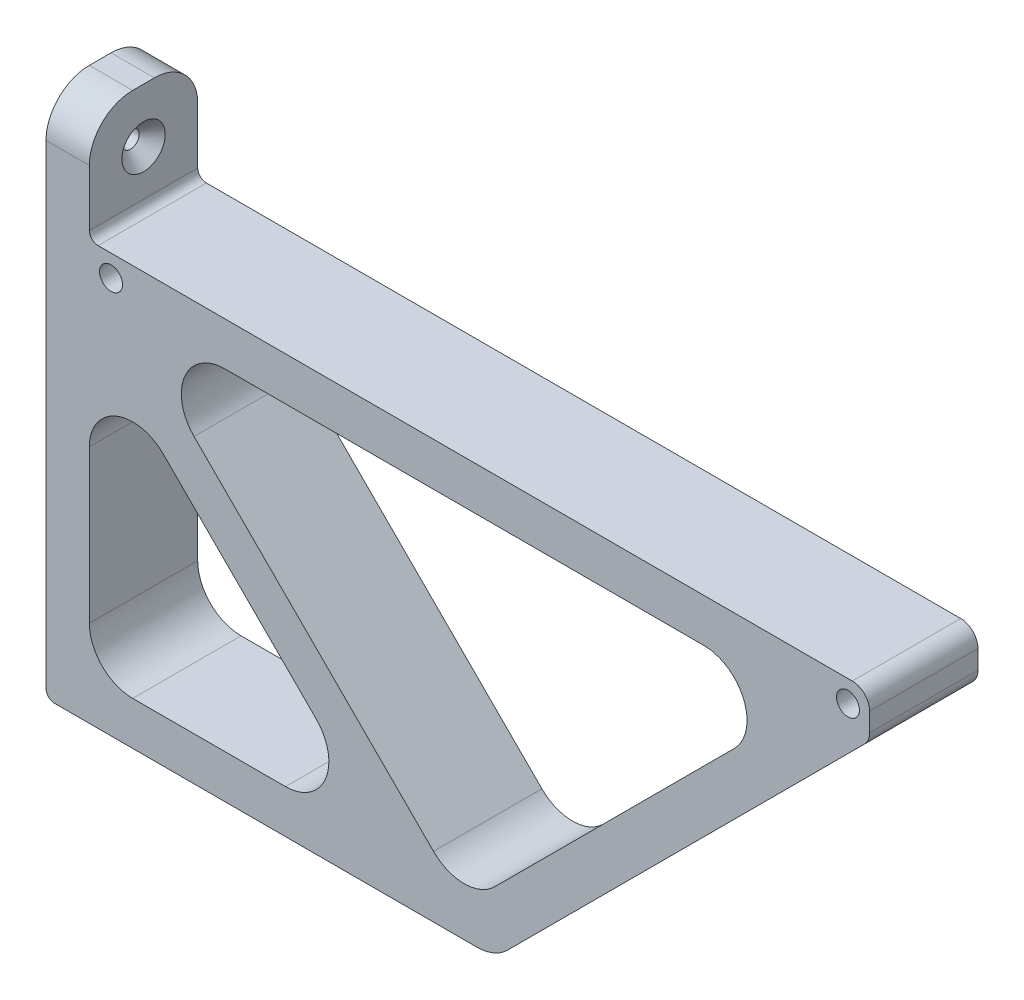
ISO-10303-21;
HEADER;
FILE_DESCRIPTION(('STEP AP214'),'2;1');
FILE_NAME('part.step','',(''),(''),'','','');
FILE_SCHEMA(('AUTOMOTIVE_DESIGN { 1 0 10303 214 1 1 1 1 }'));
ENDSEC;
DATA;
#1=APPLICATION_CONTEXT('core data for automotive mechanical design processes');
#2=APPLICATION_PROTOCOL_DEFINITION('international standard','automotive_design',2000,#1);
#3=PRODUCT_CONTEXT('',#1,'mechanical');
#4=PRODUCT('Part','Part','',(#3));
#5=PRODUCT_RELATED_PRODUCT_CATEGORY('part','',(#4));
#6=PRODUCT_DEFINITION_FORMATION('','',#4);
#7=PRODUCT_DEFINITION_CONTEXT('part definition',#1,'design');
#8=PRODUCT_DEFINITION('design','',#6,#7);
#9=PRODUCT_DEFINITION_SHAPE('','',#8);
#10=(LENGTH_UNIT() NAMED_UNIT(*) SI_UNIT(.MILLI.,.METRE.));
#11=(NAMED_UNIT(*) PLANE_ANGLE_UNIT() SI_UNIT($,.RADIAN.));
#12=(NAMED_UNIT(*) SI_UNIT($,.STERADIAN.) SOLID_ANGLE_UNIT());
#13=UNCERTAINTY_MEASURE_WITH_UNIT(LENGTH_MEASURE(1.E-05),#10,'distance_accuracy_value','');
#14=(GEOMETRIC_REPRESENTATION_CONTEXT(3) GLOBAL_UNCERTAINTY_ASSIGNED_CONTEXT((#13)) GLOBAL_UNIT_ASSIGNED_CONTEXT((#10,
#11,#12)) REPRESENTATION_CONTEXT('',''));
#15=CARTESIAN_POINT('',(0.,0.,0.));
#16=DIRECTION('',(0.,0.,1.));
#17=DIRECTION('',(1.,0.,0.));
#18=AXIS2_PLACEMENT_3D('',#15,#16,#17);
#19=CARTESIAN_POINT('',(0.,0.,25.));
#20=DIRECTION('',(0.,0.,1.));
#21=DIRECTION('',(1.,0.,0.));
#22=AXIS2_PLACEMENT_3D('',#19,#20,#21);
#23=PLANE('',#22);
#24=CARTESIAN_POINT('',(5.,-30.,25.));
#25=DIRECTION('',(0.,0.,1.));
#26=DIRECTION('',(1.,0.,0.));
#27=AXIS2_PLACEMENT_3D('',#24,#25,#26);
#28=CIRCLE('',#27,2.65);
#29=CARTESIAN_POINT('',(7.65,-30.,25.));
#30=VERTEX_POINT('',#29);
#31=EDGE_CURVE('E693',#30,#30,#28,.T.);
#32=ORIENTED_EDGE('',*,*,#31,.F.);
#33=EDGE_LOOP('',(#32));
#34=FACE_BOUND('',#33,.T.);
#35=DIRECTION('',(0.,-1.,0.));
#36=VECTOR('',#35,1.);
#37=CARTESIAN_POINT('',(-10.,0.,25.));
#38=LINE('',#37,#36);
#39=CARTESIAN_POINT('',(-10.,-10.,25.));
#40=VERTEX_POINT('',#39);
#41=CARTESIAN_POINT('',(-9.99999999999999,-119.464466094067,25.));
#42=VERTEX_POINT('',#41);
#43=EDGE_CURVE('E214',#40,#42,#38,.T.);
#44=ORIENTED_EDGE('',*,*,#43,.T.);
#45=CARTESIAN_POINT('',(-7.99999999999998,-119.464466094067,25.));
#46=DIRECTION('',(0.,0.,1.));
#47=DIRECTION('',(1.,0.,0.));
#48=AXIS2_PLACEMENT_3D('',#45,#46,#47);
#49=CIRCLE('',#48,2.);
#50=CARTESIAN_POINT('',(-7.99999999999998,-121.464466094067,25.));
#51=VERTEX_POINT('',#50);
#52=EDGE_CURVE('E344',#42,#51,#49,.T.);
#53=ORIENTED_EDGE('',*,*,#52,.T.);
#54=DIRECTION('',(1.,0.,0.));
#55=VECTOR('',#54,1.);
#56=CARTESIAN_POINT('',(93.5355339059347,-121.464466094067,25.));
#57=LINE('',#56,#55);
#58=CARTESIAN_POINT('',(89.3933982822037,-121.464466094067,25.));
#59=VERTEX_POINT('',#58);
#60=EDGE_CURVE('E661',#51,#59,#57,.T.);
#61=ORIENTED_EDGE('',*,*,#60,.T.);
#62=CARTESIAN_POINT('',(89.3933982822037,-111.464466094067,25.));
#63=DIRECTION('',(0.,0.,1.));
#64=DIRECTION('',(1.,0.,0.));
#65=AXIS2_PLACEMENT_3D('',#62,#63,#64);
#66=CIRCLE('',#65,10.);
#67=CARTESIAN_POINT('',(96.4644660940693,-118.535533905933,25.));
#68=VERTEX_POINT('',#67);
#69=EDGE_CURVE('E281',#59,#68,#66,.T.);
#70=ORIENTED_EDGE('',*,*,#69,.T.);
#71=DIRECTION('',(0.707106781186539,0.707106781186556,0.));
#72=VECTOR('',#71,1.);
#73=CARTESIAN_POINT('',(93.5355339059347,-121.464466094067,25.));
#74=LINE('',#73,#72);
#75=CARTESIAN_POINT('',(178.828427124746,-36.1715728752538,25.));
#76=VERTEX_POINT('',#75);
#77=EDGE_CURVE('E664',#68,#76,#74,.T.);
#78=ORIENTED_EDGE('',*,*,#77,.T.);
#79=CARTESIAN_POINT('',(176.,-33.3431457505076,25.));
#80=DIRECTION('',(0.,0.,1.));
#81=DIRECTION('',(1.,0.,0.));
#82=AXIS2_PLACEMENT_3D('',#79,#80,#81);
#83=CIRCLE('',#82,4.);
#84=CARTESIAN_POINT('',(180.,-33.3431457505076,25.));
#85=VERTEX_POINT('',#84);
#86=EDGE_CURVE('E267',#76,#85,#83,.T.);
#87=ORIENTED_EDGE('',*,*,#86,.T.);
#88=DIRECTION('',(0.,1.,0.));
#89=VECTOR('',#88,1.);
#90=CARTESIAN_POINT('',(180.,-25.,25.));
#91=LINE('',#90,#89);
#92=CARTESIAN_POINT('',(180.,-29.,25.));
#93=VERTEX_POINT('',#92);
#94=EDGE_CURVE('E369',#85,#93,#91,.T.);
#95=ORIENTED_EDGE('',*,*,#94,.T.);
#96=CARTESIAN_POINT('',(176.,-29.,25.));
#97=DIRECTION('',(0.,0.,1.));
#98=DIRECTION('',(1.,0.,0.));
#99=AXIS2_PLACEMENT_3D('',#96,#97,#98);
#100=CIRCLE('',#99,4.);
#101=CARTESIAN_POINT('',(176.,-25.,25.));
#102=VERTEX_POINT('',#101);
#103=EDGE_CURVE('E265',#93,#102,#100,.T.);
#104=ORIENTED_EDGE('',*,*,#103,.T.);
#105=DIRECTION('',(-1.,0.,0.));
#106=VECTOR('',#105,1.);
#107=CARTESIAN_POINT('',(0.,-25.,25.));
#108=LINE('',#107,#106);
#109=CARTESIAN_POINT('',(2.,-25.,25.));
#110=VERTEX_POINT('',#109);
#111=EDGE_CURVE('E366',#102,#110,#108,.T.);
#112=ORIENTED_EDGE('',*,*,#111,.T.);
#113=CARTESIAN_POINT('',(2.,-23.,25.));
#114=DIRECTION('',(0.,0.,1.));
#115=DIRECTION('',(1.,0.,0.));
#116=AXIS2_PLACEMENT_3D('',#113,#114,#115);
#117=CIRCLE('',#116,2.);
#118=CARTESIAN_POINT('',(0.,-23.,25.));
#119=VERTEX_POINT('',#118);
#120=EDGE_CURVE('E11',#110,#119,#117,.F.);
#121=ORIENTED_EDGE('',*,*,#120,.T.);
#122=DIRECTION('',(0.,1.,0.));
#123=VECTOR('',#122,1.);
#124=CARTESIAN_POINT('',(0.,0.,25.));
#125=LINE('',#124,#123);
#126=CARTESIAN_POINT('',(0.,-10.,25.));
#127=VERTEX_POINT('',#126);
#128=EDGE_CURVE('E365',#119,#127,#125,.T.);
#129=ORIENTED_EDGE('',*,*,#128,.T.);
#130=DIRECTION('',(-1.,0.,0.));
#131=VECTOR('',#130,1.);
#132=CARTESIAN_POINT('',(-10.,-10.,25.));
#133=LINE('',#132,#131);
#134=EDGE_CURVE('E250',#127,#40,#133,.T.);
#135=ORIENTED_EDGE('',*,*,#134,.T.);
#136=EDGE_LOOP('',(#44,#53,#61,#70,#78,#87,#95,#104,#112,#121,#129,#135));
#137=FACE_BOUND('',#136,.T.);
#138=DIRECTION('',(1.,0.,0.));
#139=VECTOR('',#138,1.);
#140=CARTESIAN_POINT('',(0.,-111.464466094067,25.));
#141=LINE('',#140,#139);
#142=CARTESIAN_POINT('',(10.,-111.464466094067,25.));
#143=VERTEX_POINT('',#142);
#144=CARTESIAN_POINT('',(45.2512626584723,-111.464466094067,25.));
#145=VERTEX_POINT('',#144);
#146=EDGE_CURVE('E696',#143,#145,#141,.T.);
#147=ORIENTED_EDGE('',*,*,#146,.F.);
#148=CARTESIAN_POINT('',(10.,-101.464466094067,25.));
#149=DIRECTION('',(0.,0.,1.));
#150=DIRECTION('',(1.,0.,0.));
#151=AXIS2_PLACEMENT_3D('',#148,#149,#150);
#152=CIRCLE('',#151,10.);
#153=CARTESIAN_POINT('',(0.,-101.464466094067,25.));
#154=VERTEX_POINT('',#153);
#155=EDGE_CURVE('E319',#143,#154,#152,.F.);
#156=ORIENTED_EDGE('',*,*,#155,.T.);
#157=DIRECTION('',(0.,-1.,0.));
#158=VECTOR('',#157,1.);
#159=CARTESIAN_POINT('',(0.,-111.464466094067,25.));
#160=LINE('',#159,#158);
#161=CARTESIAN_POINT('',(0.,-66.2132034355959,25.));
#162=VERTEX_POINT('',#161);
#163=EDGE_CURVE('E686',#162,#154,#160,.T.);
#164=ORIENTED_EDGE('',*,*,#163,.F.);
#165=CARTESIAN_POINT('',(10.,-66.2132034355959,25.));
#166=DIRECTION('',(0.,0.,1.));
#167=DIRECTION('',(1.,0.,0.));
#168=AXIS2_PLACEMENT_3D('',#165,#166,#167);
#169=CIRCLE('',#168,10.);
#170=CARTESIAN_POINT('',(17.0710678118654,-59.1421356237304,25.));
#171=VERTEX_POINT('',#170);
#172=EDGE_CURVE('E315',#162,#171,#169,.F.);
#173=ORIENTED_EDGE('',*,*,#172,.T.);
#174=DIRECTION('',(-0.707106781186556,0.707106781186539,0.));
#175=VECTOR('',#174,1.);
#176=CARTESIAN_POINT('',(0.,-42.0710678118654,25.));
#177=LINE('',#176,#175);
#178=CARTESIAN_POINT('',(52.3223304703377,-94.3933982822018,25.));
#179=VERTEX_POINT('',#178);
#180=EDGE_CURVE('E376',#179,#171,#177,.T.);
#181=ORIENTED_EDGE('',*,*,#180,.F.);
#182=CARTESIAN_POINT('',(45.2512626584723,-101.464466094067,25.));
#183=DIRECTION('',(0.,0.,1.));
#184=DIRECTION('',(1.,0.,0.));
#185=AXIS2_PLACEMENT_3D('',#182,#183,#184);
#186=CIRCLE('',#185,10.);
#187=EDGE_CURVE('E323',#179,#145,#186,.F.);
#188=ORIENTED_EDGE('',*,*,#187,.T.);
#189=EDGE_LOOP('',(#147,#156,#164,#173,#181,#188));
#190=FACE_BOUND('',#189,.T.);
#191=CARTESIAN_POINT('',(175.,-30.,25.));
#192=DIRECTION('',(0.,0.,1.));
#193=DIRECTION('',(1.,0.,0.));
#194=AXIS2_PLACEMENT_3D('',#191,#192,#193);
#195=CIRCLE('',#194,2.65000000000001);
#196=CARTESIAN_POINT('',(177.65,-30.,25.));
#197=VERTEX_POINT('',#196);
#198=EDGE_CURVE('E704',#197,#197,#195,.T.);
#199=ORIENTED_EDGE('',*,*,#198,.F.);
#200=EDGE_LOOP('',(#199));
#201=FACE_BOUND('',#200,.T.);
#202=DIRECTION('',(0.707106781186556,-0.707106781186539,0.));
#203=VECTOR('',#202,1.);
#204=CARTESIAN_POINT('',(7.07106781186556,-35.,25.));
#205=LINE('',#204,#203);
#206=CARTESIAN_POINT('',(24.1421356237315,-52.0710678118656,25.));
#207=VERTEX_POINT('',#206);
#208=CARTESIAN_POINT('',(79.3933982822037,-107.322330470336,25.));
#209=VERTEX_POINT('',#208);
#210=EDGE_CURVE('E726',#207,#209,#205,.T.);
#211=ORIENTED_EDGE('',*,*,#210,.F.);
#212=CARTESIAN_POINT('',(31.2132034355969,-45.,25.));
#213=DIRECTION('',(0.,0.,1.));
#214=DIRECTION('',(1.,0.,0.));
#215=AXIS2_PLACEMENT_3D('',#212,#213,#214);
#216=CIRCLE('',#215,10.);
#217=CARTESIAN_POINT('',(31.2132034355969,-35.,25.));
#218=VERTEX_POINT('',#217);
#219=EDGE_CURVE('E335',#207,#218,#216,.F.);
#220=ORIENTED_EDGE('',*,*,#219,.T.);
#221=DIRECTION('',(-1.,0.,0.));
#222=VECTOR('',#221,1.);
#223=CARTESIAN_POINT('',(165.857864376269,-35.,25.));
#224=LINE('',#223,#222);
#225=CARTESIAN_POINT('',(141.715728752539,-35.,25.));
#226=VERTEX_POINT('',#225);
#227=EDGE_CURVE('E716',#226,#218,#224,.T.);
#228=ORIENTED_EDGE('',*,*,#227,.F.);
#229=CARTESIAN_POINT('',(141.715728752539,-45.,25.));
#230=DIRECTION('',(0.,0.,1.));
#231=DIRECTION('',(1.,0.,0.));
#232=AXIS2_PLACEMENT_3D('',#229,#230,#231);
#233=CIRCLE('',#232,10.);
#234=CARTESIAN_POINT('',(148.786796564404,-52.0710678118654,25.));
#235=VERTEX_POINT('',#234);
#236=EDGE_CURVE('E331',#226,#235,#233,.F.);
#237=ORIENTED_EDGE('',*,*,#236,.T.);
#238=DIRECTION('',(0.707106781186539,0.707106781186556,0.));
#239=VECTOR('',#238,1.);
#240=CARTESIAN_POINT('',(86.4644660940693,-114.393398282202,25.));
#241=LINE('',#240,#239);
#242=CARTESIAN_POINT('',(93.5355339059347,-107.322330470336,25.));
#243=VERTEX_POINT('',#242);
#244=EDGE_CURVE('E710',#243,#235,#241,.T.);
#245=ORIENTED_EDGE('',*,*,#244,.F.);
#246=CARTESIAN_POINT('',(86.4644660940692,-100.251262658471,25.));
#247=DIRECTION('',(0.,0.,1.));
#248=DIRECTION('',(1.,0.,0.));
#249=AXIS2_PLACEMENT_3D('',#246,#247,#248);
#250=CIRCLE('',#249,10.);
#251=EDGE_CURVE('E327',#243,#209,#250,.F.);
#252=ORIENTED_EDGE('',*,*,#251,.T.);
#253=EDGE_LOOP('',(#211,#220,#228,#237,#245,#252));
#254=FACE_BOUND('',#253,.T.);
#255=ADVANCED_FACE('F35',(#34,#137,#190,#201,#254),#23,.T.);
#256=CARTESIAN_POINT('',(0.,0.,0.));
#257=DIRECTION('',(0.,0.,1.));
#258=DIRECTION('',(1.,0.,0.));
#259=AXIS2_PLACEMENT_3D('',#256,#257,#258);
#260=PLANE('',#259);
#261=CARTESIAN_POINT('',(175.,-30.,0.));
#262=DIRECTION('',(0.,0.,1.));
#263=DIRECTION('',(1.,0.,0.));
#264=AXIS2_PLACEMENT_3D('',#261,#262,#263);
#265=CIRCLE('',#264,2.65000000000001);
#266=CARTESIAN_POINT('',(177.65,-30.,0.));
#267=VERTEX_POINT('',#266);
#268=EDGE_CURVE('E707',#267,#267,#265,.T.);
#269=ORIENTED_EDGE('',*,*,#268,.T.);
#270=EDGE_LOOP('',(#269));
#271=FACE_BOUND('',#270,.T.);
#272=CARTESIAN_POINT('',(5.,-30.,0.));
#273=DIRECTION('',(0.,0.,1.));
#274=DIRECTION('',(1.,0.,0.));
#275=AXIS2_PLACEMENT_3D('',#272,#273,#274);
#276=CIRCLE('',#275,2.65);
#277=CARTESIAN_POINT('',(7.65,-30.,0.));
#278=VERTEX_POINT('',#277);
#279=EDGE_CURVE('E701',#278,#278,#276,.T.);
#280=ORIENTED_EDGE('',*,*,#279,.T.);
#281=EDGE_LOOP('',(#280));
#282=FACE_BOUND('',#281,.T.);
#283=DIRECTION('',(-0.707106781186556,0.707106781186539,0.));
#284=VECTOR('',#283,1.);
#285=CARTESIAN_POINT('',(0.,-42.0710678118654,0.));
#286=LINE('',#285,#284);
#287=CARTESIAN_POINT('',(52.3223304703377,-94.3933982822018,0.));
#288=VERTEX_POINT('',#287);
#289=CARTESIAN_POINT('',(17.0710678118654,-59.1421356237304,0.));
#290=VERTEX_POINT('',#289);
#291=EDGE_CURVE('E683',#288,#290,#286,.T.);
#292=ORIENTED_EDGE('',*,*,#291,.T.);
#293=CARTESIAN_POINT('',(10.,-66.2132034355959,0.));
#294=DIRECTION('',(0.,0.,1.));
#295=DIRECTION('',(1.,0.,0.));
#296=AXIS2_PLACEMENT_3D('',#293,#294,#295);
#297=CIRCLE('',#296,10.);
#298=CARTESIAN_POINT('',(0.,-66.2132034355959,0.));
#299=VERTEX_POINT('',#298);
#300=EDGE_CURVE('E313',#290,#299,#297,.T.);
#301=ORIENTED_EDGE('',*,*,#300,.T.);
#302=DIRECTION('',(0.,-1.,0.));
#303=VECTOR('',#302,1.);
#304=CARTESIAN_POINT('',(0.,-111.464466094067,0.));
#305=LINE('',#304,#303);
#306=CARTESIAN_POINT('',(0.,-101.464466094067,0.));
#307=VERTEX_POINT('',#306);
#308=EDGE_CURVE('E690',#299,#307,#305,.T.);
#309=ORIENTED_EDGE('',*,*,#308,.T.);
#310=CARTESIAN_POINT('',(10.,-101.464466094067,0.));
#311=DIRECTION('',(0.,0.,1.));
#312=DIRECTION('',(1.,0.,0.));
#313=AXIS2_PLACEMENT_3D('',#310,#311,#312);
#314=CIRCLE('',#313,10.);
#315=CARTESIAN_POINT('',(10.,-111.464466094067,0.));
#316=VERTEX_POINT('',#315);
#317=EDGE_CURVE('E317',#307,#316,#314,.T.);
#318=ORIENTED_EDGE('',*,*,#317,.T.);
#319=DIRECTION('',(1.,0.,0.));
#320=VECTOR('',#319,1.);
#321=CARTESIAN_POINT('',(0.,-111.464466094067,0.));
#322=LINE('',#321,#320);
#323=CARTESIAN_POINT('',(45.2512626584723,-111.464466094067,0.));
#324=VERTEX_POINT('',#323);
#325=EDGE_CURVE('E687',#316,#324,#322,.T.);
#326=ORIENTED_EDGE('',*,*,#325,.T.);
#327=CARTESIAN_POINT('',(45.2512626584723,-101.464466094067,0.));
#328=DIRECTION('',(0.,0.,1.));
#329=DIRECTION('',(1.,0.,0.));
#330=AXIS2_PLACEMENT_3D('',#327,#328,#329);
#331=CIRCLE('',#330,10.);
#332=EDGE_CURVE('E321',#324,#288,#331,.T.);
#333=ORIENTED_EDGE('',*,*,#332,.T.);
#334=EDGE_LOOP('',(#292,#301,#309,#318,#326,#333));
#335=FACE_BOUND('',#334,.T.);
#336=DIRECTION('',(1.,0.,0.));
#337=VECTOR('',#336,1.);
#338=CARTESIAN_POINT('',(93.5355339059347,-121.464466094067,0.));
#339=LINE('',#338,#337);
#340=CARTESIAN_POINT('',(-7.99999999999998,-121.464466094067,0.));
#341=VERTEX_POINT('',#340);
#342=CARTESIAN_POINT('',(89.3933982822037,-121.464466094067,0.));
#343=VERTEX_POINT('',#342);
#344=EDGE_CURVE('E375',#341,#343,#339,.T.);
#345=ORIENTED_EDGE('',*,*,#344,.F.);
#346=CARTESIAN_POINT('',(-7.99999999999998,-119.464466094067,0.));
#347=DIRECTION('',(0.,0.,1.));
#348=DIRECTION('',(1.,0.,0.));
#349=AXIS2_PLACEMENT_3D('',#346,#347,#348);
#350=CIRCLE('',#349,2.);
#351=CARTESIAN_POINT('',(-9.99999999999999,-119.464466094067,0.));
#352=VERTEX_POINT('',#351);
#353=EDGE_CURVE('E340',#341,#352,#350,.F.);
#354=ORIENTED_EDGE('',*,*,#353,.T.);
#355=DIRECTION('',(0.,-1.,0.));
#356=VECTOR('',#355,1.);
#357=CARTESIAN_POINT('',(-10.,0.,0.));
#358=LINE('',#357,#356);
#359=CARTESIAN_POINT('',(-10.,-10.,0.));
#360=VERTEX_POINT('',#359);
#361=EDGE_CURVE('E373',#360,#352,#358,.T.);
#362=ORIENTED_EDGE('',*,*,#361,.F.);
#363=DIRECTION('',(-1.,0.,0.));
#364=VECTOR('',#363,1.);
#365=CARTESIAN_POINT('',(0.,-10.,0.));
#366=LINE('',#365,#364);
#367=CARTESIAN_POINT('',(0.,-10.,0.));
#368=VERTEX_POINT('',#367);
#369=EDGE_CURVE('E244',#360,#368,#366,.F.);
#370=ORIENTED_EDGE('',*,*,#369,.T.);
#371=DIRECTION('',(0.,1.,0.));
#372=VECTOR('',#371,1.);
#373=CARTESIAN_POINT('',(0.,0.,0.));
#374=LINE('',#373,#372);
#375=CARTESIAN_POINT('',(0.,-23.,0.));
#376=VERTEX_POINT('',#375);
#377=EDGE_CURVE('E356',#376,#368,#374,.T.);
#378=ORIENTED_EDGE('',*,*,#377,.F.);
#379=CARTESIAN_POINT('',(2.,-23.,0.));
#380=DIRECTION('',(0.,0.,1.));
#381=DIRECTION('',(1.,0.,0.));
#382=AXIS2_PLACEMENT_3D('',#379,#380,#381);
#383=CIRCLE('',#382,2.);
#384=CARTESIAN_POINT('',(2.,-25.,0.));
#385=VERTEX_POINT('',#384);
#386=EDGE_CURVE('E43',#376,#385,#383,.T.);
#387=ORIENTED_EDGE('',*,*,#386,.T.);
#388=DIRECTION('',(-1.,0.,0.));
#389=VECTOR('',#388,1.);
#390=CARTESIAN_POINT('',(0.,-25.,0.));
#391=LINE('',#390,#389);
#392=CARTESIAN_POINT('',(176.,-25.,0.));
#393=VERTEX_POINT('',#392);
#394=EDGE_CURVE('E355',#393,#385,#391,.T.);
#395=ORIENTED_EDGE('',*,*,#394,.F.);
#396=CARTESIAN_POINT('',(176.,-29.,0.));
#397=DIRECTION('',(0.,0.,1.));
#398=DIRECTION('',(1.,0.,0.));
#399=AXIS2_PLACEMENT_3D('',#396,#397,#398);
#400=CIRCLE('',#399,4.);
#401=CARTESIAN_POINT('',(180.,-29.,0.));
#402=VERTEX_POINT('',#401);
#403=EDGE_CURVE('E257',#393,#402,#400,.F.);
#404=ORIENTED_EDGE('',*,*,#403,.T.);
#405=DIRECTION('',(0.,1.,0.));
#406=VECTOR('',#405,1.);
#407=CARTESIAN_POINT('',(180.,-25.,0.));
#408=LINE('',#407,#406);
#409=CARTESIAN_POINT('',(180.,-33.3431457505076,0.));
#410=VERTEX_POINT('',#409);
#411=EDGE_CURVE('E361',#410,#402,#408,.T.);
#412=ORIENTED_EDGE('',*,*,#411,.F.);
#413=CARTESIAN_POINT('',(176.,-33.3431457505076,0.));
#414=DIRECTION('',(0.,0.,1.));
#415=DIRECTION('',(1.,0.,0.));
#416=AXIS2_PLACEMENT_3D('',#413,#414,#415);
#417=CIRCLE('',#416,4.);
#418=CARTESIAN_POINT('',(178.828427124746,-36.1715728752538,0.));
#419=VERTEX_POINT('',#418);
#420=EDGE_CURVE('E259',#410,#419,#417,.F.);
#421=ORIENTED_EDGE('',*,*,#420,.T.);
#422=DIRECTION('',(0.707106781186539,0.707106781186556,0.));
#423=VECTOR('',#422,1.);
#424=CARTESIAN_POINT('',(93.5355339059347,-121.464466094067,0.));
#425=LINE('',#424,#423);
#426=CARTESIAN_POINT('',(96.4644660940693,-118.535533905933,0.));
#427=VERTEX_POINT('',#426);
#428=EDGE_CURVE('E378',#427,#419,#425,.T.);
#429=ORIENTED_EDGE('',*,*,#428,.F.);
#430=CARTESIAN_POINT('',(89.3933982822037,-111.464466094067,0.));
#431=DIRECTION('',(0.,0.,1.));
#432=DIRECTION('',(1.,0.,0.));
#433=AXIS2_PLACEMENT_3D('',#430,#431,#432);
#434=CIRCLE('',#433,10.);
#435=EDGE_CURVE('E275',#427,#343,#434,.F.);
#436=ORIENTED_EDGE('',*,*,#435,.T.);
#437=EDGE_LOOP('',(#345,#354,#362,#370,#378,#387,#395,#404,#412,#421,#429,#436));
#438=FACE_BOUND('',#437,.T.);
#439=DIRECTION('',(0.707106781186539,0.707106781186556,0.));
#440=VECTOR('',#439,1.);
#441=CARTESIAN_POINT('',(86.4644660940693,-114.393398282202,0.));
#442=LINE('',#441,#440);
#443=CARTESIAN_POINT('',(93.5355339059347,-107.322330470336,0.));
#444=VERTEX_POINT('',#443);
#445=CARTESIAN_POINT('',(148.786796564404,-52.0710678118654,0.));
#446=VERTEX_POINT('',#445);
#447=EDGE_CURVE('E713',#444,#446,#442,.T.);
#448=ORIENTED_EDGE('',*,*,#447,.T.);
#449=CARTESIAN_POINT('',(141.715728752539,-45.,0.));
#450=DIRECTION('',(0.,0.,1.));
#451=DIRECTION('',(1.,0.,0.));
#452=AXIS2_PLACEMENT_3D('',#449,#450,#451);
#453=CIRCLE('',#452,10.);
#454=CARTESIAN_POINT('',(141.715728752539,-35.,0.));
#455=VERTEX_POINT('',#454);
#456=EDGE_CURVE('E329',#446,#455,#453,.T.);
#457=ORIENTED_EDGE('',*,*,#456,.T.);
#458=DIRECTION('',(-1.,0.,0.));
#459=VECTOR('',#458,1.);
#460=CARTESIAN_POINT('',(165.857864376269,-35.,0.));
#461=LINE('',#460,#459);
#462=CARTESIAN_POINT('',(31.2132034355969,-35.,0.));
#463=VERTEX_POINT('',#462);
#464=EDGE_CURVE('E720',#455,#463,#461,.T.);
#465=ORIENTED_EDGE('',*,*,#464,.T.);
#466=CARTESIAN_POINT('',(31.2132034355969,-45.,0.));
#467=DIRECTION('',(0.,0.,1.));
#468=DIRECTION('',(1.,0.,0.));
#469=AXIS2_PLACEMENT_3D('',#466,#467,#468);
#470=CIRCLE('',#469,10.);
#471=CARTESIAN_POINT('',(24.1421356237315,-52.0710678118656,0.));
#472=VERTEX_POINT('',#471);
#473=EDGE_CURVE('E333',#463,#472,#470,.T.);
#474=ORIENTED_EDGE('',*,*,#473,.T.);
#475=DIRECTION('',(0.707106781186556,-0.707106781186539,0.));
#476=VECTOR('',#475,1.);
#477=CARTESIAN_POINT('',(7.07106781186556,-35.,0.));
#478=LINE('',#477,#476);
#479=CARTESIAN_POINT('',(79.3933982822037,-107.322330470336,0.));
#480=VERTEX_POINT('',#479);
#481=EDGE_CURVE('E717',#472,#480,#478,.T.);
#482=ORIENTED_EDGE('',*,*,#481,.T.);
#483=CARTESIAN_POINT('',(86.4644660940692,-100.251262658471,0.));
#484=DIRECTION('',(0.,0.,1.));
#485=DIRECTION('',(1.,0.,0.));
#486=AXIS2_PLACEMENT_3D('',#483,#484,#485);
#487=CIRCLE('',#486,10.);
#488=EDGE_CURVE('E325',#480,#444,#487,.T.);
#489=ORIENTED_EDGE('',*,*,#488,.T.);
#490=EDGE_LOOP('',(#448,#457,#465,#474,#482,#489));
#491=FACE_BOUND('',#490,.T.);
#492=ADVANCED_FACE('F353',(#271,#282,#335,#438,#491),#260,.F.);
#493=CARTESIAN_POINT('',(0.,0.,25.));
#494=DIRECTION('',(0.,-1.,0.));
#495=DIRECTION('',(1.,0.,0.));
#496=AXIS2_PLACEMENT_3D('',#493,#494,#495);
#497=PLANE('',#496);
#498=DIRECTION('',(0.,0.,-1.));
#499=VECTOR('',#498,1.);
#500=CARTESIAN_POINT('',(0.,0.,25.));
#501=LINE('',#500,#499);
#502=CARTESIAN_POINT('',(0.,0.,15.));
#503=VERTEX_POINT('',#502);
#504=CARTESIAN_POINT('',(0.,0.,10.));
#505=VERTEX_POINT('',#504);
#506=EDGE_CURVE('E230',#503,#505,#501,.T.);
#507=ORIENTED_EDGE('',*,*,#506,.T.);
#508=DIRECTION('',(-1.,0.,0.));
#509=VECTOR('',#508,1.);
#510=CARTESIAN_POINT('',(0.,0.,10.));
#511=LINE('',#510,#509);
#512=CARTESIAN_POINT('',(-10.,0.,10.));
#513=VERTEX_POINT('',#512);
#514=EDGE_CURVE('E220',#505,#513,#511,.T.);
#515=ORIENTED_EDGE('',*,*,#514,.T.);
#516=DIRECTION('',(0.,0.,-1.));
#517=VECTOR('',#516,1.);
#518=CARTESIAN_POINT('',(-10.,0.,25.));
#519=LINE('',#518,#517);
#520=CARTESIAN_POINT('',(-10.,0.,15.));
#521=VERTEX_POINT('',#520);
#522=EDGE_CURVE('E212',#521,#513,#519,.T.);
#523=ORIENTED_EDGE('',*,*,#522,.F.);
#524=DIRECTION('',(-1.,0.,0.));
#525=VECTOR('',#524,1.);
#526=CARTESIAN_POINT('',(0.,0.,15.));
#527=LINE('',#526,#525);
#528=EDGE_CURVE('E226',#521,#503,#527,.F.);
#529=ORIENTED_EDGE('',*,*,#528,.T.);
#530=EDGE_LOOP('',(#507,#515,#523,#529));
#531=FACE_BOUND('',#530,.T.);
#532=ADVANCED_FACE('F225',(#531),#497,.F.);
#533=CARTESIAN_POINT('',(-10.,0.,25.));
#534=DIRECTION('',(1.,0.,0.));
#535=DIRECTION('',(0.,1.,0.));
#536=AXIS2_PLACEMENT_3D('',#533,#534,#535);
#537=PLANE('',#536);
#538=CARTESIAN_POINT('',(-10.,-12.5,12.5));
#539=DIRECTION('',(1.,0.,0.));
#540=DIRECTION('',(0.,0.,-1.));
#541=AXIS2_PLACEMENT_3D('',#538,#539,#540);
#542=CIRCLE('',#541,2.);
#543=CARTESIAN_POINT('',(-10.,-12.5,10.5));
#544=VERTEX_POINT('',#543);
#545=EDGE_CURVE('E723',#544,#544,#542,.T.);
#546=ORIENTED_EDGE('',*,*,#545,.T.);
#547=EDGE_LOOP('',(#546));
#548=FACE_BOUND('',#547,.T.);
#549=ORIENTED_EDGE('',*,*,#361,.T.);
#550=DIRECTION('',(0.,0.,-1.));
#551=VECTOR('',#550,1.);
#552=CARTESIAN_POINT('',(-9.99999999999999,-119.464466094067,25.));
#553=LINE('',#552,#551);
#554=EDGE_CURVE('E342',#352,#42,#553,.F.);
#555=ORIENTED_EDGE('',*,*,#554,.T.);
#556=ORIENTED_EDGE('',*,*,#43,.F.);
#557=CARTESIAN_POINT('',(-10.,-10.,15.));
#558=DIRECTION('',(1.,0.,0.));
#559=DIRECTION('',(0.,1.,0.));
#560=AXIS2_PLACEMENT_3D('',#557,#558,#559);
#561=CIRCLE('',#560,10.);
#562=EDGE_CURVE('E208',#40,#521,#561,.F.);
#563=ORIENTED_EDGE('',*,*,#562,.T.);
#564=ORIENTED_EDGE('',*,*,#522,.T.);
#565=CARTESIAN_POINT('',(-10.,-10.,10.));
#566=DIRECTION('',(1.,0.,0.));
#567=DIRECTION('',(0.,1.,0.));
#568=AXIS2_PLACEMENT_3D('',#565,#566,#567);
#569=CIRCLE('',#568,10.);
#570=EDGE_CURVE('E219',#513,#360,#569,.F.);
#571=ORIENTED_EDGE('',*,*,#570,.T.);
#572=EDGE_LOOP('',(#549,#555,#556,#563,#564,#571));
#573=FACE_BOUND('',#572,.T.);
#574=ADVANCED_FACE('F211',(#548,#573),#537,.F.);
#575=CARTESIAN_POINT('',(93.5355339059347,-121.464466094067,25.));
#576=DIRECTION('',(0.,1.,0.));
#577=DIRECTION('',(-1.,0.,0.));
#578=AXIS2_PLACEMENT_3D('',#575,#576,#577);
#579=PLANE('',#578);
#580=ORIENTED_EDGE('',*,*,#60,.F.);
#581=DIRECTION('',(0.,0.,-1.));
#582=VECTOR('',#581,1.);
#583=CARTESIAN_POINT('',(-7.99999999999998,-121.464466094067,25.));
#584=LINE('',#583,#582);
#585=EDGE_CURVE('E337',#51,#341,#584,.T.);
#586=ORIENTED_EDGE('',*,*,#585,.T.);
#587=ORIENTED_EDGE('',*,*,#344,.T.);
#588=DIRECTION('',(0.,0.,-1.));
#589=VECTOR('',#588,1.);
#590=CARTESIAN_POINT('',(89.3933982822037,-121.464466094067,25.));
#591=LINE('',#590,#589);
#592=EDGE_CURVE('E278',#343,#59,#591,.F.);
#593=ORIENTED_EDGE('',*,*,#592,.T.);
#594=EDGE_LOOP('',(#580,#586,#587,#593));
#595=FACE_BOUND('',#594,.T.);
#596=ADVANCED_FACE('F428',(#595),#579,.F.);
#597=CARTESIAN_POINT('',(93.5355339059347,-121.464466094067,25.));
#598=DIRECTION('',(-0.707106781186556,0.707106781186539,0.));
#599=DIRECTION('',(-0.707106781186539,-0.707106781186556,0.));
#600=AXIS2_PLACEMENT_3D('',#597,#598,#599);
#601=PLANE('',#600);
#602=ORIENTED_EDGE('',*,*,#77,.F.);
#603=DIRECTION('',(0.,0.,-1.));
#604=VECTOR('',#603,1.);
#605=CARTESIAN_POINT('',(96.4644660940693,-118.535533905933,25.));
#606=LINE('',#605,#604);
#607=EDGE_CURVE('E272',#68,#427,#606,.T.);
#608=ORIENTED_EDGE('',*,*,#607,.T.);
#609=ORIENTED_EDGE('',*,*,#428,.T.);
#610=DIRECTION('',(0.,0.,-1.));
#611=VECTOR('',#610,1.);
#612=CARTESIAN_POINT('',(178.828427124746,-36.1715728752538,25.));
#613=LINE('',#612,#611);
#614=EDGE_CURVE('E262',#419,#76,#613,.F.);
#615=ORIENTED_EDGE('',*,*,#614,.T.);
#616=EDGE_LOOP('',(#602,#608,#609,#615));
#617=FACE_BOUND('',#616,.T.);
#618=ADVANCED_FACE('F424',(#617),#601,.F.);
#619=CARTESIAN_POINT('',(180.,-25.,25.));
#620=DIRECTION('',(-1.,0.,0.));
#621=DIRECTION('',(0.,0.,1.));
#622=AXIS2_PLACEMENT_3D('',#619,#620,#621);
#623=PLANE('',#622);
#624=ORIENTED_EDGE('',*,*,#94,.F.);
#625=DIRECTION('',(0.,0.,-1.));
#626=VECTOR('',#625,1.);
#627=CARTESIAN_POINT('',(180.,-33.3431457505076,25.));
#628=LINE('',#627,#626);
#629=EDGE_CURVE('E254',#85,#410,#628,.T.);
#630=ORIENTED_EDGE('',*,*,#629,.T.);
#631=ORIENTED_EDGE('',*,*,#411,.T.);
#632=DIRECTION('',(0.,0.,-1.));
#633=VECTOR('',#632,1.);
#634=CARTESIAN_POINT('',(180.,-29.,25.));
#635=LINE('',#634,#633);
#636=EDGE_CURVE('E252',#402,#93,#635,.F.);
#637=ORIENTED_EDGE('',*,*,#636,.T.);
#638=EDGE_LOOP('',(#624,#630,#631,#637));
#639=FACE_BOUND('',#638,.T.);
#640=ADVANCED_FACE('F421',(#639),#623,.F.);
#641=CARTESIAN_POINT('',(0.,-25.,25.));
#642=DIRECTION('',(0.,-1.,0.));
#643=DIRECTION('',(0.,0.,-1.));
#644=AXIS2_PLACEMENT_3D('',#641,#642,#643);
#645=PLANE('',#644);
#646=ORIENTED_EDGE('',*,*,#394,.T.);
#647=DIRECTION('',(0.,0.,-1.));
#648=VECTOR('',#647,1.);
#649=CARTESIAN_POINT('',(2.,-25.,25.));
#650=LINE('',#649,#648);
#651=EDGE_CURVE('E56',#385,#110,#650,.F.);
#652=ORIENTED_EDGE('',*,*,#651,.T.);
#653=ORIENTED_EDGE('',*,*,#111,.F.);
#654=DIRECTION('',(0.,0.,-1.));
#655=VECTOR('',#654,1.);
#656=CARTESIAN_POINT('',(176.,-25.,25.));
#657=LINE('',#656,#655);
#658=EDGE_CURVE('E269',#102,#393,#657,.T.);
#659=ORIENTED_EDGE('',*,*,#658,.T.);
#660=EDGE_LOOP('',(#646,#652,#653,#659));
#661=FACE_BOUND('',#660,.T.);
#662=ADVANCED_FACE('F359',(#661),#645,.F.);
#663=CARTESIAN_POINT('',(0.,0.,25.));
#664=DIRECTION('',(-1.,0.,0.));
#665=DIRECTION('',(0.,-1.,0.));
#666=AXIS2_PLACEMENT_3D('',#663,#664,#665);
#667=PLANE('',#666);
#668=CARTESIAN_POINT('',(0.,-12.5,12.5));
#669=DIRECTION('',(-1.,0.,0.));
#670=DIRECTION('',(0.,-1.,0.));
#671=AXIS2_PLACEMENT_3D('',#668,#669,#670);
#672=CIRCLE('',#671,5.);
#673=CARTESIAN_POINT('',(0.,-17.5,12.5));
#674=VERTEX_POINT('',#673);
#675=EDGE_CURVE('E236',#674,#674,#672,.T.);
#676=ORIENTED_EDGE('',*,*,#675,.T.);
#677=EDGE_LOOP('',(#676));
#678=FACE_BOUND('',#677,.T.);
#679=ORIENTED_EDGE('',*,*,#128,.F.);
#680=DIRECTION('',(0.,0.,-1.));
#681=VECTOR('',#680,1.);
#682=CARTESIAN_POINT('',(0.,-23.,0.));
#683=LINE('',#682,#681);
#684=EDGE_CURVE('E346',#119,#376,#683,.T.);
#685=ORIENTED_EDGE('',*,*,#684,.T.);
#686=ORIENTED_EDGE('',*,*,#377,.T.);
#687=CARTESIAN_POINT('',(0.,-10.,10.));
#688=DIRECTION('',(-1.,0.,0.));
#689=DIRECTION('',(0.,-1.,0.));
#690=AXIS2_PLACEMENT_3D('',#687,#688,#689);
#691=CIRCLE('',#690,10.);
#692=EDGE_CURVE('E248',#368,#505,#691,.F.);
#693=ORIENTED_EDGE('',*,*,#692,.T.);
#694=ORIENTED_EDGE('',*,*,#506,.F.);
#695=CARTESIAN_POINT('',(0.,-10.,15.));
#696=DIRECTION('',(-1.,0.,0.));
#697=DIRECTION('',(0.,-1.,0.));
#698=AXIS2_PLACEMENT_3D('',#695,#696,#697);
#699=CIRCLE('',#698,10.);
#700=EDGE_CURVE('E235',#503,#127,#699,.F.);
#701=ORIENTED_EDGE('',*,*,#700,.T.);
#702=EDGE_LOOP('',(#679,#685,#686,#693,#694,#701));
#703=FACE_BOUND('',#702,.T.);
#704=ADVANCED_FACE('F364',(#678,#703),#667,.F.);
#705=CARTESIAN_POINT('',(0.,-111.464466094067,25.));
#706=DIRECTION('',(1.,0.,0.));
#707=DIRECTION('',(0.,0.,-1.));
#708=AXIS2_PLACEMENT_3D('',#705,#706,#707);
#709=PLANE('',#708);
#710=ORIENTED_EDGE('',*,*,#308,.F.);
#711=DIRECTION('',(0.,0.,-1.));
#712=VECTOR('',#711,1.);
#713=CARTESIAN_POINT('',(0.,-66.2132034355959,25.));
#714=LINE('',#713,#712);
#715=EDGE_CURVE('E291',#299,#162,#714,.F.);
#716=ORIENTED_EDGE('',*,*,#715,.T.);
#717=ORIENTED_EDGE('',*,*,#163,.T.);
#718=DIRECTION('',(0.,0.,-1.));
#719=VECTOR('',#718,1.);
#720=CARTESIAN_POINT('',(0.,-101.464466094067,0.));
#721=LINE('',#720,#719);
#722=EDGE_CURVE('E288',#154,#307,#721,.T.);
#723=ORIENTED_EDGE('',*,*,#722,.T.);
#724=EDGE_LOOP('',(#710,#716,#717,#723));
#725=FACE_BOUND('',#724,.T.);
#726=ADVANCED_FACE('F413',(#725),#709,.T.);
#727=CARTESIAN_POINT('',(0.,-111.464466094067,25.));
#728=DIRECTION('',(0.,1.,0.));
#729=DIRECTION('',(-1.,0.,0.));
#730=AXIS2_PLACEMENT_3D('',#727,#728,#729);
#731=PLANE('',#730);
#732=ORIENTED_EDGE('',*,*,#325,.F.);
#733=DIRECTION('',(0.,0.,-1.));
#734=VECTOR('',#733,1.);
#735=CARTESIAN_POINT('',(10.,-111.464466094067,25.));
#736=LINE('',#735,#734);
#737=EDGE_CURVE('E296',#316,#143,#736,.F.);
#738=ORIENTED_EDGE('',*,*,#737,.T.);
#739=ORIENTED_EDGE('',*,*,#146,.T.);
#740=DIRECTION('',(0.,0.,-1.));
#741=VECTOR('',#740,1.);
#742=CARTESIAN_POINT('',(45.2512626584723,-111.464466094067,0.));
#743=LINE('',#742,#741);
#744=EDGE_CURVE('E293',#145,#324,#743,.T.);
#745=ORIENTED_EDGE('',*,*,#744,.T.);
#746=EDGE_LOOP('',(#732,#738,#739,#745));
#747=FACE_BOUND('',#746,.T.);
#748=ADVANCED_FACE('F476',(#747),#731,.T.);
#749=CARTESIAN_POINT('',(0.,-42.0710678118654,25.));
#750=DIRECTION('',(-0.707106781186539,-0.707106781186556,0.));
#751=DIRECTION('',(0.707106781186556,-0.707106781186539,0.));
#752=AXIS2_PLACEMENT_3D('',#749,#750,#751);
#753=PLANE('',#752);
#754=ORIENTED_EDGE('',*,*,#180,.T.);
#755=DIRECTION('',(0.,0.,-1.));
#756=VECTOR('',#755,1.);
#757=CARTESIAN_POINT('',(17.0710678118654,-59.1421356237304,0.));
#758=LINE('',#757,#756);
#759=EDGE_CURVE('E285',#171,#290,#758,.T.);
#760=ORIENTED_EDGE('',*,*,#759,.T.);
#761=ORIENTED_EDGE('',*,*,#291,.F.);
#762=DIRECTION('',(0.,0.,-1.));
#763=VECTOR('',#762,1.);
#764=CARTESIAN_POINT('',(52.3223304703377,-94.3933982822018,25.));
#765=LINE('',#764,#763);
#766=EDGE_CURVE('E283',#288,#179,#765,.F.);
#767=ORIENTED_EDGE('',*,*,#766,.T.);
#768=EDGE_LOOP('',(#754,#760,#761,#767));
#769=FACE_BOUND('',#768,.T.);
#770=ADVANCED_FACE('F483',(#769),#753,.T.);
#771=CARTESIAN_POINT('',(5.,-30.,25.));
#772=DIRECTION('',(0.,0.,-1.));
#773=DIRECTION('',(-1.,0.,0.));
#774=AXIS2_PLACEMENT_3D('',#771,#772,#773);
#775=CYLINDRICAL_SURFACE('',#774,2.65);
#776=ORIENTED_EDGE('',*,*,#31,.T.);
#777=EDGE_LOOP('',(#776));
#778=FACE_BOUND('',#777,.T.);
#779=ORIENTED_EDGE('',*,*,#279,.F.);
#780=EDGE_LOOP('',(#779));
#781=FACE_BOUND('',#780,.T.);
#782=ADVANCED_FACE('F490',(#778,#781),#775,.F.);
#783=CARTESIAN_POINT('',(175.,-30.,25.));
#784=DIRECTION('',(0.,0.,-1.));
#785=DIRECTION('',(-1.,0.,0.));
#786=AXIS2_PLACEMENT_3D('',#783,#784,#785);
#787=CYLINDRICAL_SURFACE('',#786,2.65000000000001);
#788=ORIENTED_EDGE('',*,*,#198,.T.);
#789=EDGE_LOOP('',(#788));
#790=FACE_BOUND('',#789,.T.);
#791=ORIENTED_EDGE('',*,*,#268,.F.);
#792=EDGE_LOOP('',(#791));
#793=FACE_BOUND('',#792,.T.);
#794=ADVANCED_FACE('F499',(#790,#793),#787,.F.);
#795=CARTESIAN_POINT('',(165.857864376269,-35.,25.));
#796=DIRECTION('',(0.,-1.,0.));
#797=DIRECTION('',(0.,0.,-1.));
#798=AXIS2_PLACEMENT_3D('',#795,#796,#797);
#799=PLANE('',#798);
#800=ORIENTED_EDGE('',*,*,#464,.F.);
#801=DIRECTION('',(0.,0.,-1.));
#802=VECTOR('',#801,1.);
#803=CARTESIAN_POINT('',(141.715728752539,-35.,25.));
#804=LINE('',#803,#802);
#805=EDGE_CURVE('E311',#455,#226,#804,.F.);
#806=ORIENTED_EDGE('',*,*,#805,.T.);
#807=ORIENTED_EDGE('',*,*,#227,.T.);
#808=DIRECTION('',(0.,0.,-1.));
#809=VECTOR('',#808,1.);
#810=CARTESIAN_POINT('',(31.2132034355969,-35.,0.));
#811=LINE('',#810,#809);
#812=EDGE_CURVE('E308',#218,#463,#811,.T.);
#813=ORIENTED_EDGE('',*,*,#812,.T.);
#814=EDGE_LOOP('',(#800,#806,#807,#813));
#815=FACE_BOUND('',#814,.T.);
#816=ADVANCED_FACE('F507',(#815),#799,.T.);
#817=CARTESIAN_POINT('',(7.07106781186556,-35.,25.));
#818=DIRECTION('',(0.707106781186539,0.707106781186556,0.));
#819=DIRECTION('',(-0.707106781186556,0.707106781186539,0.));
#820=AXIS2_PLACEMENT_3D('',#817,#818,#819);
#821=PLANE('',#820);
#822=ORIENTED_EDGE('',*,*,#210,.T.);
#823=DIRECTION('',(0.,0.,-1.));
#824=VECTOR('',#823,1.);
#825=CARTESIAN_POINT('',(79.3933982822038,-107.322330470336,0.));
#826=LINE('',#825,#824);
#827=EDGE_CURVE('E300',#209,#480,#826,.T.);
#828=ORIENTED_EDGE('',*,*,#827,.T.);
#829=ORIENTED_EDGE('',*,*,#481,.F.);
#830=DIRECTION('',(0.,0.,-1.));
#831=VECTOR('',#830,1.);
#832=CARTESIAN_POINT('',(24.1421356237315,-52.0710678118656,25.));
#833=LINE('',#832,#831);
#834=EDGE_CURVE('E298',#472,#207,#833,.F.);
#835=ORIENTED_EDGE('',*,*,#834,.T.);
#836=EDGE_LOOP('',(#822,#828,#829,#835));
#837=FACE_BOUND('',#836,.T.);
#838=ADVANCED_FACE('F515',(#837),#821,.T.);
#839=CARTESIAN_POINT('',(86.4644660940693,-114.393398282202,25.));
#840=DIRECTION('',(-0.707106781186556,0.707106781186539,0.));
#841=DIRECTION('',(-0.707106781186539,-0.707106781186556,0.));
#842=AXIS2_PLACEMENT_3D('',#839,#840,#841);
#843=PLANE('',#842);
#844=ORIENTED_EDGE('',*,*,#447,.F.);
#845=DIRECTION('',(0.,0.,-1.));
#846=VECTOR('',#845,1.);
#847=CARTESIAN_POINT('',(93.5355339059347,-107.322330470336,25.));
#848=LINE('',#847,#846);
#849=EDGE_CURVE('E306',#444,#243,#848,.F.);
#850=ORIENTED_EDGE('',*,*,#849,.T.);
#851=ORIENTED_EDGE('',*,*,#244,.T.);
#852=DIRECTION('',(0.,0.,-1.));
#853=VECTOR('',#852,1.);
#854=CARTESIAN_POINT('',(148.786796564404,-52.0710678118654,0.));
#855=LINE('',#854,#853);
#856=EDGE_CURVE('E303',#235,#446,#855,.T.);
#857=ORIENTED_EDGE('',*,*,#856,.T.);
#858=EDGE_LOOP('',(#844,#850,#851,#857));
#859=FACE_BOUND('',#858,.T.);
#860=ADVANCED_FACE('F399',(#859),#843,.T.);
#861=CARTESIAN_POINT('',(-10.,-12.5,12.5));
#862=DIRECTION('',(1.,0.,0.));
#863=DIRECTION('',(0.,0.,-1.));
#864=AXIS2_PLACEMENT_3D('',#861,#862,#863);
#865=CYLINDRICAL_SURFACE('',#864,2.);
#866=CARTESIAN_POINT('',(-2.99999999999998,-12.5,12.5));
#867=DIRECTION('',(-1.,0.,0.));
#868=DIRECTION('',(0.,0.,1.));
#869=AXIS2_PLACEMENT_3D('',#866,#867,#868);
#870=CIRCLE('',#869,2.);
#871=CARTESIAN_POINT('',(-2.99999999999998,-12.5,14.5));
#872=VERTEX_POINT('',#871);
#873=EDGE_CURVE('E229',#872,#872,#870,.F.);
#874=ORIENTED_EDGE('',*,*,#873,.T.);
#875=EDGE_LOOP('',(#874));
#876=FACE_BOUND('',#875,.T.);
#877=ORIENTED_EDGE('',*,*,#545,.F.);
#878=EDGE_LOOP('',(#877));
#879=FACE_BOUND('',#878,.T.);
#880=ADVANCED_FACE('F385',(#876,#879),#865,.F.);
#881=CARTESIAN_POINT('',(-2.99999999999998,-12.5,12.5));
#882=DIRECTION('',(1.,0.,0.));
#883=DIRECTION('',(0.,0.,-1.));
#884=AXIS2_PLACEMENT_3D('',#881,#882,#883);
#885=CONICAL_SURFACE('',#884,2.,0.785398163397452);
#886=ORIENTED_EDGE('',*,*,#675,.F.);
#887=EDGE_LOOP('',(#886));
#888=FACE_BOUND('',#887,.T.);
#889=ORIENTED_EDGE('',*,*,#873,.F.);
#890=EDGE_LOOP('',(#889));
#891=FACE_BOUND('',#890,.T.);
#892=ADVANCED_FACE('F388',(#888,#891),#885,.F.);
#893=CARTESIAN_POINT('',(0.,-10.,10.));
#894=DIRECTION('',(-1.,0.,0.));
#895=DIRECTION('',(0.,-1.,0.));
#896=AXIS2_PLACEMENT_3D('',#893,#894,#895);
#897=CYLINDRICAL_SURFACE('',#896,10.);
#898=ORIENTED_EDGE('',*,*,#692,.F.);
#899=ORIENTED_EDGE('',*,*,#369,.F.);
#900=ORIENTED_EDGE('',*,*,#570,.F.);
#901=ORIENTED_EDGE('',*,*,#514,.F.);
#902=EDGE_LOOP('',(#898,#899,#900,#901));
#903=FACE_BOUND('',#902,.T.);
#904=ADVANCED_FACE('F390',(#903),#897,.T.);
#905=CARTESIAN_POINT('',(0.,-10.,15.));
#906=DIRECTION('',(1.,0.,0.));
#907=DIRECTION('',(0.,1.,0.));
#908=AXIS2_PLACEMENT_3D('',#905,#906,#907);
#909=CYLINDRICAL_SURFACE('',#908,10.);
#910=ORIENTED_EDGE('',*,*,#700,.F.);
#911=ORIENTED_EDGE('',*,*,#528,.F.);
#912=ORIENTED_EDGE('',*,*,#562,.F.);
#913=ORIENTED_EDGE('',*,*,#134,.F.);
#914=EDGE_LOOP('',(#910,#911,#912,#913));
#915=FACE_BOUND('',#914,.T.);
#916=ADVANCED_FACE('F233',(#915),#909,.T.);
#917=CARTESIAN_POINT('',(176.,-33.3431457505076,25.));
#918=DIRECTION('',(0.,0.,-1.));
#919=DIRECTION('',(-1.,0.,0.));
#920=AXIS2_PLACEMENT_3D('',#917,#918,#919);
#921=CYLINDRICAL_SURFACE('',#920,4.);
#922=ORIENTED_EDGE('',*,*,#86,.F.);
#923=ORIENTED_EDGE('',*,*,#614,.F.);
#924=ORIENTED_EDGE('',*,*,#420,.F.);
#925=ORIENTED_EDGE('',*,*,#629,.F.);
#926=EDGE_LOOP('',(#922,#923,#924,#925));
#927=FACE_BOUND('',#926,.T.);
#928=ADVANCED_FACE('F552',(#927),#921,.T.);
#929=CARTESIAN_POINT('',(176.,-29.,25.));
#930=DIRECTION('',(0.,0.,-1.));
#931=DIRECTION('',(-1.,0.,0.));
#932=AXIS2_PLACEMENT_3D('',#929,#930,#931);
#933=CYLINDRICAL_SURFACE('',#932,4.);
#934=ORIENTED_EDGE('',*,*,#103,.F.);
#935=ORIENTED_EDGE('',*,*,#636,.F.);
#936=ORIENTED_EDGE('',*,*,#403,.F.);
#937=ORIENTED_EDGE('',*,*,#658,.F.);
#938=EDGE_LOOP('',(#934,#935,#936,#937));
#939=FACE_BOUND('',#938,.T.);
#940=ADVANCED_FACE('F559',(#939),#933,.T.);
#941=CARTESIAN_POINT('',(89.3933982822037,-111.464466094067,25.));
#942=DIRECTION('',(0.,0.,-1.));
#943=DIRECTION('',(-1.,0.,0.));
#944=AXIS2_PLACEMENT_3D('',#941,#942,#943);
#945=CYLINDRICAL_SURFACE('',#944,10.);
#946=ORIENTED_EDGE('',*,*,#69,.F.);
#947=ORIENTED_EDGE('',*,*,#592,.F.);
#948=ORIENTED_EDGE('',*,*,#435,.F.);
#949=ORIENTED_EDGE('',*,*,#607,.F.);
#950=EDGE_LOOP('',(#946,#947,#948,#949));
#951=FACE_BOUND('',#950,.T.);
#952=ADVANCED_FACE('F567',(#951),#945,.T.);
#953=CARTESIAN_POINT('',(10.,-66.2132034355959,25.));
#954=DIRECTION('',(0.,0.,1.));
#955=DIRECTION('',(1.,0.,0.));
#956=AXIS2_PLACEMENT_3D('',#953,#954,#955);
#957=CYLINDRICAL_SURFACE('',#956,10.);
#958=ORIENTED_EDGE('',*,*,#172,.F.);
#959=ORIENTED_EDGE('',*,*,#715,.F.);
#960=ORIENTED_EDGE('',*,*,#300,.F.);
#961=ORIENTED_EDGE('',*,*,#759,.F.);
#962=EDGE_LOOP('',(#958,#959,#960,#961));
#963=FACE_BOUND('',#962,.T.);
#964=ADVANCED_FACE('F575',(#963),#957,.F.);
#965=CARTESIAN_POINT('',(10.,-101.464466094067,25.));
#966=DIRECTION('',(0.,0.,1.));
#967=DIRECTION('',(1.,0.,0.));
#968=AXIS2_PLACEMENT_3D('',#965,#966,#967);
#969=CYLINDRICAL_SURFACE('',#968,10.);
#970=ORIENTED_EDGE('',*,*,#155,.F.);
#971=ORIENTED_EDGE('',*,*,#737,.F.);
#972=ORIENTED_EDGE('',*,*,#317,.F.);
#973=ORIENTED_EDGE('',*,*,#722,.F.);
#974=EDGE_LOOP('',(#970,#971,#972,#973));
#975=FACE_BOUND('',#974,.T.);
#976=ADVANCED_FACE('F583',(#975),#969,.F.);
#977=CARTESIAN_POINT('',(45.2512626584723,-101.464466094067,25.));
#978=DIRECTION('',(0.,0.,1.));
#979=DIRECTION('',(1.,0.,0.));
#980=AXIS2_PLACEMENT_3D('',#977,#978,#979);
#981=CYLINDRICAL_SURFACE('',#980,10.);
#982=ORIENTED_EDGE('',*,*,#187,.F.);
#983=ORIENTED_EDGE('',*,*,#766,.F.);
#984=ORIENTED_EDGE('',*,*,#332,.F.);
#985=ORIENTED_EDGE('',*,*,#744,.F.);
#986=EDGE_LOOP('',(#982,#983,#984,#985));
#987=FACE_BOUND('',#986,.T.);
#988=ADVANCED_FACE('F592',(#987),#981,.F.);
#989=CARTESIAN_POINT('',(86.4644660940692,-100.251262658471,25.));
#990=DIRECTION('',(0.,0.,1.));
#991=DIRECTION('',(1.,0.,0.));
#992=AXIS2_PLACEMENT_3D('',#989,#990,#991);
#993=CYLINDRICAL_SURFACE('',#992,10.);
#994=ORIENTED_EDGE('',*,*,#251,.F.);
#995=ORIENTED_EDGE('',*,*,#849,.F.);
#996=ORIENTED_EDGE('',*,*,#488,.F.);
#997=ORIENTED_EDGE('',*,*,#827,.F.);
#998=EDGE_LOOP('',(#994,#995,#996,#997));
#999=FACE_BOUND('',#998,.T.);
#1000=ADVANCED_FACE('F601',(#999),#993,.F.);
#1001=CARTESIAN_POINT('',(141.715728752539,-45.,25.));
#1002=DIRECTION('',(0.,0.,1.));
#1003=DIRECTION('',(1.,0.,0.));
#1004=AXIS2_PLACEMENT_3D('',#1001,#1002,#1003);
#1005=CYLINDRICAL_SURFACE('',#1004,10.);
#1006=ORIENTED_EDGE('',*,*,#236,.F.);
#1007=ORIENTED_EDGE('',*,*,#805,.F.);
#1008=ORIENTED_EDGE('',*,*,#456,.F.);
#1009=ORIENTED_EDGE('',*,*,#856,.F.);
#1010=EDGE_LOOP('',(#1006,#1007,#1008,#1009));
#1011=FACE_BOUND('',#1010,.T.);
#1012=ADVANCED_FACE('F610',(#1011),#1005,.F.);
#1013=CARTESIAN_POINT('',(31.2132034355969,-45.,25.));
#1014=DIRECTION('',(0.,0.,1.));
#1015=DIRECTION('',(1.,0.,0.));
#1016=AXIS2_PLACEMENT_3D('',#1013,#1014,#1015);
#1017=CYLINDRICAL_SURFACE('',#1016,10.);
#1018=ORIENTED_EDGE('',*,*,#219,.F.);
#1019=ORIENTED_EDGE('',*,*,#834,.F.);
#1020=ORIENTED_EDGE('',*,*,#473,.F.);
#1021=ORIENTED_EDGE('',*,*,#812,.F.);
#1022=EDGE_LOOP('',(#1018,#1019,#1020,#1021));
#1023=FACE_BOUND('',#1022,.T.);
#1024=ADVANCED_FACE('F619',(#1023),#1017,.F.);
#1025=CARTESIAN_POINT('',(-7.99999999999998,-119.464466094067,25.));
#1026=DIRECTION('',(0.,0.,-1.));
#1027=DIRECTION('',(-1.,0.,0.));
#1028=AXIS2_PLACEMENT_3D('',#1025,#1026,#1027);
#1029=CYLINDRICAL_SURFACE('',#1028,2.);
#1030=ORIENTED_EDGE('',*,*,#52,.F.);
#1031=ORIENTED_EDGE('',*,*,#554,.F.);
#1032=ORIENTED_EDGE('',*,*,#353,.F.);
#1033=ORIENTED_EDGE('',*,*,#585,.F.);
#1034=EDGE_LOOP('',(#1030,#1031,#1032,#1033));
#1035=FACE_BOUND('',#1034,.T.);
#1036=ADVANCED_FACE('F628',(#1035),#1029,.T.);
#1037=CARTESIAN_POINT('',(2.,-23.,25.));
#1038=DIRECTION('',(0.,0.,1.));
#1039=DIRECTION('',(1.,0.,0.));
#1040=AXIS2_PLACEMENT_3D('',#1037,#1038,#1039);
#1041=CYLINDRICAL_SURFACE('',#1040,2.);
#1042=ORIENTED_EDGE('',*,*,#120,.F.);
#1043=ORIENTED_EDGE('',*,*,#651,.F.);
#1044=ORIENTED_EDGE('',*,*,#386,.F.);
#1045=ORIENTED_EDGE('',*,*,#684,.F.);
#1046=EDGE_LOOP('',(#1042,#1043,#1044,#1045));
#1047=FACE_BOUND('',#1046,.T.);
#1048=ADVANCED_FACE('F37',(#1047),#1041,.F.);
#1049=CLOSED_SHELL('',(#255,#492,#532,#574,#596,#618,#640,#662,#704,#726,#748,#770,#782,#794,
#816,#838,#860,#880,#892,#904,#916,#928,#940,#952,#964,#976,#988,#1000,#1012,#1024,#1036,#1048));
#1050=MANIFOLD_SOLID_BREP('B2',#1049);
#1051=ADVANCED_BREP_SHAPE_REPRESENTATION('',(#18,#1050),#14);
#1052=SHAPE_DEFINITION_REPRESENTATION(#9,#1051);
ENDSEC;
END-ISO-10303-21;
